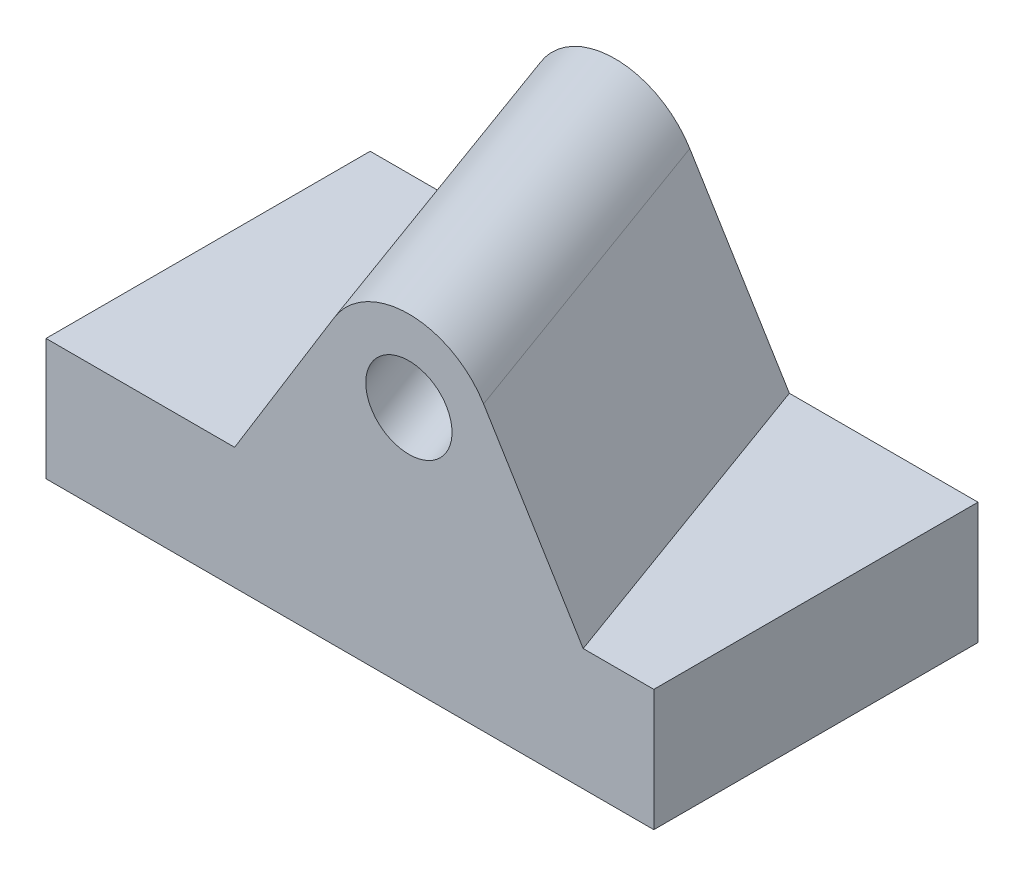
ISO-10303-21;
HEADER;
FILE_DESCRIPTION(('STEP AP214'),'2;1');
FILE_NAME('part.step','',(''),(''),'','','');
FILE_SCHEMA(('AUTOMOTIVE_DESIGN { 1 0 10303 214 1 1 1 1 }'));
ENDSEC;
DATA;
#1=APPLICATION_CONTEXT('core data for automotive mechanical design processes');
#2=APPLICATION_PROTOCOL_DEFINITION('international standard','automotive_design',2000,#1);
#3=PRODUCT_CONTEXT('',#1,'mechanical');
#4=PRODUCT('Part','Part','',(#3));
#5=PRODUCT_RELATED_PRODUCT_CATEGORY('part','',(#4));
#6=PRODUCT_DEFINITION_FORMATION('','',#4);
#7=PRODUCT_DEFINITION_CONTEXT('part definition',#1,'design');
#8=PRODUCT_DEFINITION('design','',#6,#7);
#9=PRODUCT_DEFINITION_SHAPE('','',#8);
#10=(LENGTH_UNIT() NAMED_UNIT(*) SI_UNIT(.MILLI.,.METRE.));
#11=(NAMED_UNIT(*) PLANE_ANGLE_UNIT() SI_UNIT($,.RADIAN.));
#12=(NAMED_UNIT(*) SI_UNIT($,.STERADIAN.) SOLID_ANGLE_UNIT());
#13=UNCERTAINTY_MEASURE_WITH_UNIT(LENGTH_MEASURE(1.E-05),#10,'distance_accuracy_value','');
#14=(GEOMETRIC_REPRESENTATION_CONTEXT(3) GLOBAL_UNCERTAINTY_ASSIGNED_CONTEXT((#13)) GLOBAL_UNIT_ASSIGNED_CONTEXT((#10,
#11,#12)) REPRESENTATION_CONTEXT('',''));
#15=CARTESIAN_POINT('',(0.,0.,0.));
#16=DIRECTION('',(0.,0.,1.));
#17=DIRECTION('',(1.,0.,0.));
#18=AXIS2_PLACEMENT_3D('',#15,#16,#17);
#19=CARTESIAN_POINT('',(75.,30.,80.));
#20=DIRECTION('',(0.,-1.,0.));
#21=DIRECTION('',(0.,0.,-1.));
#22=AXIS2_PLACEMENT_3D('',#19,#20,#21);
#23=PLANE('',#22);
#24=DIRECTION('',(-0.342020143325669,0.,-0.939692620785908));
#25=VECTOR('',#24,1.);
#26=CARTESIAN_POINT('',(86.0860561087456,30.,158.355347264244));
#27=LINE('',#26,#25);
#28=CARTESIAN_POINT('',(57.5670420089689,30.,80.));
#29=VERTEX_POINT('',#28);
#30=CARTESIAN_POINT('',(28.4494232676726,30.,0.));
#31=VERTEX_POINT('',#30);
#32=EDGE_CURVE('E58',#29,#31,#27,.T.);
#33=ORIENTED_EDGE('',*,*,#32,.F.);
#34=DIRECTION('',(-1.,0.,0.));
#35=VECTOR('',#34,1.);
#36=CARTESIAN_POINT('',(75.,30.,80.));
#37=LINE('',#36,#35);
#38=CARTESIAN_POINT('',(75.,30.,80.));
#39=VERTEX_POINT('',#38);
#40=EDGE_CURVE('E154',#39,#29,#37,.T.);
#41=ORIENTED_EDGE('',*,*,#40,.F.);
#42=DIRECTION('',(0.,0.,-1.));
#43=VECTOR('',#42,1.);
#44=CARTESIAN_POINT('',(75.,30.,80.));
#45=LINE('',#44,#43);
#46=CARTESIAN_POINT('',(75.,30.,0.));
#47=VERTEX_POINT('',#46);
#48=EDGE_CURVE('E167',#39,#47,#45,.T.);
#49=ORIENTED_EDGE('',*,*,#48,.T.);
#50=DIRECTION('',(-1.,0.,0.));
#51=VECTOR('',#50,1.);
#52=CARTESIAN_POINT('',(75.,30.,0.));
#53=LINE('',#52,#51);
#54=EDGE_CURVE('E150',#47,#31,#53,.T.);
#55=ORIENTED_EDGE('',*,*,#54,.T.);
#56=EDGE_LOOP('',(#33,#41,#49,#55));
#57=FACE_BOUND('',#56,.T.);
#58=ADVANCED_FACE('F35',(#57),#23,.F.);
#59=CARTESIAN_POINT('',(-75.,0.,80.));
#60=DIRECTION('',(1.,0.,0.));
#61=DIRECTION('',(0.,0.,-1.));
#62=AXIS2_PLACEMENT_3D('',#59,#60,#61);
#63=PLANE('',#62);
#64=DIRECTION('',(0.,-1.,0.));
#65=VECTOR('',#64,1.);
#66=CARTESIAN_POINT('',(-75.,0.,0.));
#67=LINE('',#66,#65);
#68=CARTESIAN_POINT('',(-75.,30.,0.));
#69=VERTEX_POINT('',#68);
#70=CARTESIAN_POINT('',(-75.,0.,0.));
#71=VERTEX_POINT('',#70);
#72=EDGE_CURVE('E143',#69,#71,#67,.T.);
#73=ORIENTED_EDGE('',*,*,#72,.T.);
#74=DIRECTION('',(0.,0.,-1.));
#75=VECTOR('',#74,1.);
#76=CARTESIAN_POINT('',(-75.,0.,80.));
#77=LINE('',#76,#75);
#78=CARTESIAN_POINT('',(-75.,0.,80.));
#79=VERTEX_POINT('',#78);
#80=EDGE_CURVE('E11',#79,#71,#77,.T.);
#81=ORIENTED_EDGE('',*,*,#80,.F.);
#82=DIRECTION('',(0.,-1.,0.));
#83=VECTOR('',#82,1.);
#84=CARTESIAN_POINT('',(-75.,0.,80.));
#85=LINE('',#84,#83);
#86=CARTESIAN_POINT('',(-75.,30.,80.));
#87=VERTEX_POINT('',#86);
#88=EDGE_CURVE('E146',#87,#79,#85,.T.);
#89=ORIENTED_EDGE('',*,*,#88,.F.);
#90=DIRECTION('',(0.,0.,-1.));
#91=VECTOR('',#90,1.);
#92=CARTESIAN_POINT('',(-75.,30.,80.));
#93=LINE('',#92,#91);
#94=EDGE_CURVE('E156',#87,#69,#93,.T.);
#95=ORIENTED_EDGE('',*,*,#94,.T.);
#96=EDGE_LOOP('',(#73,#81,#89,#95));
#97=FACE_BOUND('',#96,.T.);
#98=ADVANCED_FACE('F37',(#97),#63,.F.);
#99=CARTESIAN_POINT('',(-75.,0.,80.));
#100=DIRECTION('',(0.,1.,0.));
#101=DIRECTION('',(0.,0.,1.));
#102=AXIS2_PLACEMENT_3D('',#99,#100,#101);
#103=PLANE('',#102);
#104=DIRECTION('',(1.,0.,0.));
#105=VECTOR('',#104,1.);
#106=CARTESIAN_POINT('',(-75.,0.,0.));
#107=LINE('',#106,#105);
#108=CARTESIAN_POINT('',(75.,0.,0.));
#109=VERTEX_POINT('',#108);
#110=EDGE_CURVE('E159',#71,#109,#107,.T.);
#111=ORIENTED_EDGE('',*,*,#110,.T.);
#112=DIRECTION('',(0.,0.,-1.));
#113=VECTOR('',#112,1.);
#114=CARTESIAN_POINT('',(75.,0.,80.));
#115=LINE('',#114,#113);
#116=CARTESIAN_POINT('',(75.,0.,80.));
#117=VERTEX_POINT('',#116);
#118=EDGE_CURVE('E43',#117,#109,#115,.T.);
#119=ORIENTED_EDGE('',*,*,#118,.F.);
#120=DIRECTION('',(1.,0.,0.));
#121=VECTOR('',#120,1.);
#122=CARTESIAN_POINT('',(-75.,0.,80.));
#123=LINE('',#122,#121);
#124=EDGE_CURVE('E149',#79,#117,#123,.T.);
#125=ORIENTED_EDGE('',*,*,#124,.F.);
#126=ORIENTED_EDGE('',*,*,#80,.T.);
#127=EDGE_LOOP('',(#111,#119,#125,#126));
#128=FACE_BOUND('',#127,.T.);
#129=ADVANCED_FACE('F182',(#128),#103,.F.);
#130=CARTESIAN_POINT('',(75.,0.,80.));
#131=DIRECTION('',(-1.,0.,0.));
#132=DIRECTION('',(0.,0.,1.));
#133=AXIS2_PLACEMENT_3D('',#130,#131,#132);
#134=PLANE('',#133);
#135=DIRECTION('',(0.,1.,0.));
#136=VECTOR('',#135,1.);
#137=CARTESIAN_POINT('',(75.,0.,0.));
#138=LINE('',#137,#136);
#139=EDGE_CURVE('E161',#109,#47,#138,.T.);
#140=ORIENTED_EDGE('',*,*,#139,.T.);
#141=ORIENTED_EDGE('',*,*,#48,.F.);
#142=DIRECTION('',(0.,1.,0.));
#143=VECTOR('',#142,1.);
#144=CARTESIAN_POINT('',(75.,0.,80.));
#145=LINE('',#144,#143);
#146=EDGE_CURVE('E152',#117,#39,#145,.T.);
#147=ORIENTED_EDGE('',*,*,#146,.F.);
#148=ORIENTED_EDGE('',*,*,#118,.T.);
#149=EDGE_LOOP('',(#140,#141,#147,#148));
#150=FACE_BOUND('',#149,.T.);
#151=ADVANCED_FACE('F174',(#150),#134,.F.);
#152=CARTESIAN_POINT('',(-28.4494232676727,30.,80.));
#153=VERTEX_POINT('',#152);
#154=EDGE_CURVE('E50',#153,#87,#37,.T.);
#155=ORIENTED_EDGE('',*,*,#154,.F.);
#156=DIRECTION('',(-0.342020143325669,0.,-0.939692620785908));
#157=VECTOR('',#156,1.);
#158=CARTESIAN_POINT('',(10.1316058494709,30.,186.000506318673));
#159=LINE('',#158,#157);
#160=CARTESIAN_POINT('',(-57.5670420089689,30.,0.));
#161=VERTEX_POINT('',#160);
#162=EDGE_CURVE('E139',#153,#161,#159,.T.);
#163=ORIENTED_EDGE('',*,*,#162,.T.);
#164=EDGE_CURVE('E163',#161,#69,#53,.T.);
#165=ORIENTED_EDGE('',*,*,#164,.T.);
#166=ORIENTED_EDGE('',*,*,#94,.F.);
#167=EDGE_LOOP('',(#155,#163,#165,#166));
#168=FACE_BOUND('',#167,.T.);
#169=ADVANCED_FACE('F187',(#168),#23,.F.);
#170=CARTESIAN_POINT('',(0.,0.,80.));
#171=DIRECTION('',(0.,0.,1.));
#172=DIRECTION('',(1.,0.,0.));
#173=AXIS2_PLACEMENT_3D('',#170,#171,#172);
#174=PLANE('',#173);
#175=ORIENTED_EDGE('',*,*,#88,.T.);
#176=ORIENTED_EDGE('',*,*,#124,.T.);
#177=ORIENTED_EDGE('',*,*,#146,.T.);
#178=ORIENTED_EDGE('',*,*,#40,.T.);
#179=DIRECTION('',(-0.523490857349931,0.852031291837943,0.));
#180=VECTOR('',#179,1.);
#181=CARTESIAN_POINT('',(65.3824689990618,17.2796472734141,80.));
#182=LINE('',#181,#180);
#183=CARTESIAN_POINT('',(32.9909090727857,70.,80.));
#184=VERTEX_POINT('',#183);
#185=EDGE_CURVE('E137',#29,#184,#182,.T.);
#186=ORIENTED_EDGE('',*,*,#185,.T.);
#187=CARTESIAN_POINT('',(14.5588093706481,60.,80.));
#188=DIRECTION('',(0.,0.,1.));
#189=DIRECTION('',(-1.,0.,0.));
#190=AXIS2_PLACEMENT_3D('',#187,#188,#189);
#191=ELLIPSE('',#190,21.2835554495183,20.);
#192=CARTESIAN_POINT('',(-3.87329033148943,70.,80.));
#193=VERTEX_POINT('',#192);
#194=EDGE_CURVE('E106',#184,#193,#191,.T.);
#195=ORIENTED_EDGE('',*,*,#194,.T.);
#196=DIRECTION('',(-0.523490857349931,-0.852031291837943,0.));
#197=VECTOR('',#196,1.);
#198=CARTESIAN_POINT('',(5.91172347196655,85.9260430904483,80.));
#199=LINE('',#198,#197);
#200=EDGE_CURVE('E133',#193,#153,#199,.T.);
#201=ORIENTED_EDGE('',*,*,#200,.T.);
#202=ORIENTED_EDGE('',*,*,#154,.T.);
#203=EDGE_LOOP('',(#175,#176,#177,#178,#186,#195,#201,#202));
#204=FACE_BOUND('',#203,.T.);
#205=CARTESIAN_POINT('',(14.5588093706481,60.,80.));
#206=DIRECTION('',(0.,0.,1.));
#207=DIRECTION('',(-1.,0.,0.));
#208=AXIS2_PLACEMENT_3D('',#205,#206,#207);
#209=ELLIPSE('',#208,10.6417777247591,10.);
#210=CARTESIAN_POINT('',(3.91703164588899,60.,80.));
#211=VERTEX_POINT('',#210);
#212=EDGE_CURVE('E129',#211,#211,#209,.T.);
#213=ORIENTED_EDGE('',*,*,#212,.F.);
#214=EDGE_LOOP('',(#213));
#215=FACE_BOUND('',#214,.T.);
#216=ADVANCED_FACE('F178',(#204,#215),#174,.T.);
#217=CARTESIAN_POINT('',(0.,0.,0.));
#218=DIRECTION('',(0.,0.,1.));
#219=DIRECTION('',(1.,0.,0.));
#220=AXIS2_PLACEMENT_3D('',#217,#218,#219);
#221=PLANE('',#220);
#222=ORIENTED_EDGE('',*,*,#72,.F.);
#223=ORIENTED_EDGE('',*,*,#164,.F.);
#224=DIRECTION('',(0.523490857349931,0.852031291837943,0.));
#225=VECTOR('',#224,1.);
#226=CARTESIAN_POINT('',(-41.5941707882238,55.9973711278691,0.));
#227=LINE('',#226,#225);
#228=CARTESIAN_POINT('',(-32.9909090727857,70.,0.));
#229=VERTEX_POINT('',#228);
#230=EDGE_CURVE('E123',#161,#229,#227,.T.);
#231=ORIENTED_EDGE('',*,*,#230,.T.);
#232=CARTESIAN_POINT('',(-14.5588093706481,60.,0.));
#233=DIRECTION('',(0.,0.,1.));
#234=DIRECTION('',(1.,0.,0.));
#235=AXIS2_PLACEMENT_3D('',#232,#233,#234);
#236=ELLIPSE('',#235,21.2835554495183,20.);
#237=CARTESIAN_POINT('',(3.87329033148941,70.,0.));
#238=VERTEX_POINT('',#237);
#239=EDGE_CURVE('E104',#229,#238,#236,.F.);
#240=ORIENTED_EDGE('',*,*,#239,.T.);
#241=DIRECTION('',(0.523490857349931,-0.852031291837943,0.));
#242=VECTOR('',#241,1.);
#243=CARTESIAN_POINT('',(17.8765747388714,47.2083192359932,0.));
#244=LINE('',#243,#242);
#245=EDGE_CURVE('E120',#238,#31,#244,.T.);
#246=ORIENTED_EDGE('',*,*,#245,.T.);
#247=ORIENTED_EDGE('',*,*,#54,.F.);
#248=ORIENTED_EDGE('',*,*,#139,.F.);
#249=ORIENTED_EDGE('',*,*,#110,.F.);
#250=EDGE_LOOP('',(#222,#223,#231,#240,#246,#247,#248,#249));
#251=FACE_BOUND('',#250,.T.);
#252=CARTESIAN_POINT('',(-14.5588093706481,60.,0.));
#253=DIRECTION('',(0.,0.,1.));
#254=DIRECTION('',(1.,0.,0.));
#255=AXIS2_PLACEMENT_3D('',#252,#253,#254);
#256=ELLIPSE('',#255,10.6417777247591,10.);
#257=CARTESIAN_POINT('',(-3.91703164588899,60.,0.));
#258=VERTEX_POINT('',#257);
#259=EDGE_CURVE('E126',#258,#258,#256,.F.);
#260=ORIENTED_EDGE('',*,*,#259,.F.);
#261=EDGE_LOOP('',(#260));
#262=FACE_BOUND('',#261,.T.);
#263=ADVANCED_FACE('F117',(#251,#262),#221,.F.);
#264=CARTESIAN_POINT('',(31.8328773521207,70.,178.101889445979));
#265=DIRECTION('',(0.813797681349374,-0.499999999999998,-0.296198132726025));
#266=DIRECTION('',(0.523490857349931,0.852031291837943,0.));
#267=AXIS2_PLACEMENT_3D('',#264,#265,#266);
#268=PLANE('',#267);
#269=ORIENTED_EDGE('',*,*,#200,.F.);
#270=DIRECTION('',(-0.342020143325669,0.,-0.939692620785908));
#271=VECTOR('',#270,1.);
#272=CARTESIAN_POINT('',(31.8328773521207,70.,178.101889445979));
#273=LINE('',#272,#271);
#274=EDGE_CURVE('E111',#193,#229,#273,.T.);
#275=ORIENTED_EDGE('',*,*,#274,.T.);
#276=ORIENTED_EDGE('',*,*,#230,.F.);
#277=ORIENTED_EDGE('',*,*,#162,.F.);
#278=EDGE_LOOP('',(#269,#275,#276,#277));
#279=FACE_BOUND('',#278,.T.);
#280=ADVANCED_FACE('F186',(#279),#268,.F.);
#281=CARTESIAN_POINT('',(48.1088309791082,60.,172.177926791459));
#282=DIRECTION('',(-0.342020143325669,0.,-0.939692620785908));
#283=DIRECTION('',(-0.939692620785908,0.,0.342020143325669));
#284=AXIS2_PLACEMENT_3D('',#281,#282,#283);
#285=CYLINDRICAL_SURFACE('',#284,20.);
#286=ORIENTED_EDGE('',*,*,#194,.F.);
#287=DIRECTION('',(-0.342020143325669,0.,-0.939692620785908));
#288=VECTOR('',#287,1.);
#289=CARTESIAN_POINT('',(64.3847846060957,70.,166.253964136938));
#290=LINE('',#289,#288);
#291=EDGE_CURVE('E101',#184,#238,#290,.T.);
#292=ORIENTED_EDGE('',*,*,#291,.T.);
#293=ORIENTED_EDGE('',*,*,#239,.F.);
#294=ORIENTED_EDGE('',*,*,#274,.F.);
#295=EDGE_LOOP('',(#286,#292,#293,#294));
#296=FACE_BOUND('',#295,.T.);
#297=ADVANCED_FACE('F103',(#296),#285,.T.);
#298=CARTESIAN_POINT('',(86.0860561087456,30.,158.355347264244));
#299=DIRECTION('',(-0.813797681349374,-0.499999999999998,0.296198132726025));
#300=DIRECTION('',(0.523490857349931,-0.852031291837943,0.));
#301=AXIS2_PLACEMENT_3D('',#298,#299,#300);
#302=PLANE('',#301);
#303=ORIENTED_EDGE('',*,*,#185,.F.);
#304=ORIENTED_EDGE('',*,*,#32,.T.);
#305=ORIENTED_EDGE('',*,*,#245,.F.);
#306=ORIENTED_EDGE('',*,*,#291,.F.);
#307=EDGE_LOOP('',(#303,#304,#305,#306));
#308=FACE_BOUND('',#307,.T.);
#309=ADVANCED_FACE('F125',(#308),#302,.F.);
#310=CARTESIAN_POINT('',(48.1088309791082,60.,172.177926791459));
#311=DIRECTION('',(-0.342020143325669,0.,-0.939692620785908));
#312=DIRECTION('',(-0.939692620785908,0.,0.342020143325669));
#313=AXIS2_PLACEMENT_3D('',#310,#311,#312);
#314=CYLINDRICAL_SURFACE('',#313,10.);
#315=ORIENTED_EDGE('',*,*,#212,.T.);
#316=EDGE_LOOP('',(#315));
#317=FACE_BOUND('',#316,.T.);
#318=ORIENTED_EDGE('',*,*,#259,.T.);
#319=EDGE_LOOP('',(#318));
#320=FACE_BOUND('',#319,.T.);
#321=ADVANCED_FACE('F258',(#317,#320),#314,.F.);
#322=CLOSED_SHELL('',(#58,#98,#129,#151,#169,#216,#263,#280,#297,#309,#321));
#323=MANIFOLD_SOLID_BREP('B2',#322);
#324=ADVANCED_BREP_SHAPE_REPRESENTATION('',(#18,#323),#14);
#325=SHAPE_DEFINITION_REPRESENTATION(#9,#324);
ENDSEC;
END-ISO-10303-21;
